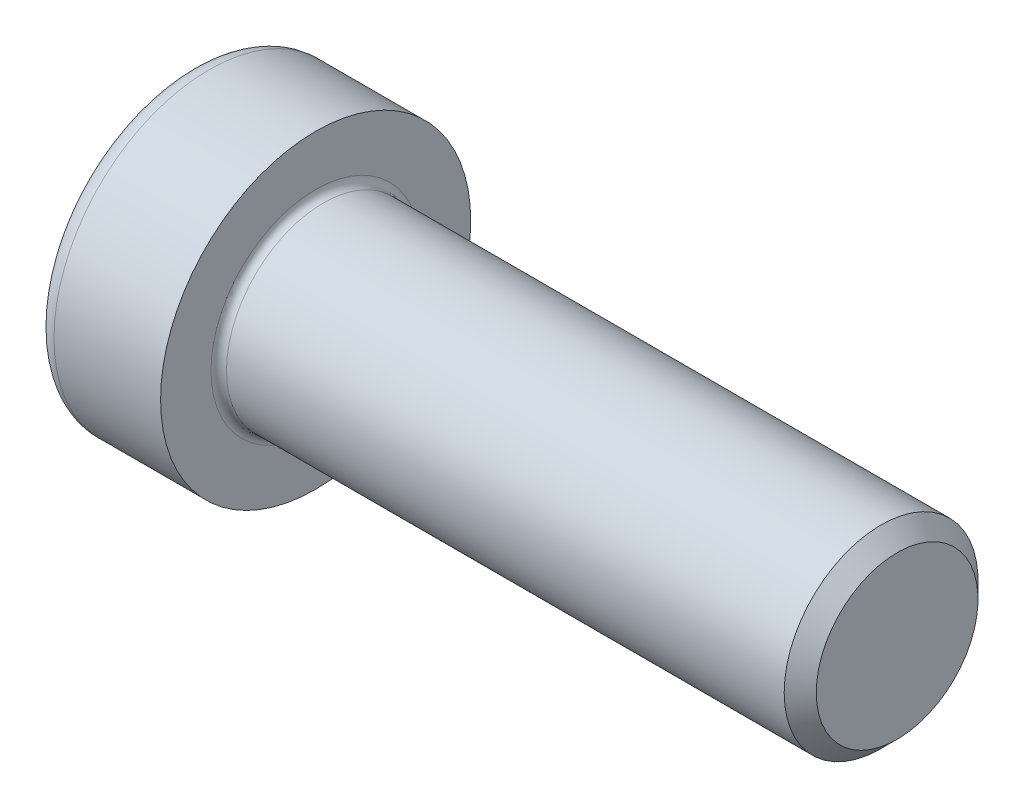
ISO-10303-21;
HEADER;
FILE_DESCRIPTION(('STEP AP214'),'2;1');
FILE_NAME('part.step','',(''),(''),'','','');
FILE_SCHEMA(('AUTOMOTIVE_DESIGN { 1 0 10303 214 1 1 1 1 }'));
ENDSEC;
DATA;
#1=APPLICATION_CONTEXT('core data for automotive mechanical design processes');
#2=APPLICATION_PROTOCOL_DEFINITION('international standard','automotive_design',2000,#1);
#3=PRODUCT_CONTEXT('',#1,'mechanical');
#4=PRODUCT('Part','Part','',(#3));
#5=PRODUCT_RELATED_PRODUCT_CATEGORY('part','',(#4));
#6=PRODUCT_DEFINITION_FORMATION('','',#4);
#7=PRODUCT_DEFINITION_CONTEXT('part definition',#1,'design');
#8=PRODUCT_DEFINITION('design','',#6,#7);
#9=PRODUCT_DEFINITION_SHAPE('','',#8);
#10=(LENGTH_UNIT() NAMED_UNIT(*) SI_UNIT(.MILLI.,.METRE.));
#11=(NAMED_UNIT(*) PLANE_ANGLE_UNIT() SI_UNIT($,.RADIAN.));
#12=(NAMED_UNIT(*) SI_UNIT($,.STERADIAN.) SOLID_ANGLE_UNIT());
#13=UNCERTAINTY_MEASURE_WITH_UNIT(LENGTH_MEASURE(1.E-05),#10,'distance_accuracy_value','');
#14=(GEOMETRIC_REPRESENTATION_CONTEXT(3) GLOBAL_UNCERTAINTY_ASSIGNED_CONTEXT((#13)) GLOBAL_UNIT_ASSIGNED_CONTEXT((#10,
#11,#12)) REPRESENTATION_CONTEXT('',''));
#15=CARTESIAN_POINT('',(0.,0.,0.));
#16=DIRECTION('',(0.,0.,1.));
#17=DIRECTION('',(1.,0.,0.));
#18=AXIS2_PLACEMENT_3D('',#15,#16,#17);
#19=CARTESIAN_POINT('',(3.65,2.35991922531261,4.08749999999999));
#20=DIRECTION('',(-1.,0.,0.));
#21=DIRECTION('',(0.,0.,1.));
#22=AXIS2_PLACEMENT_3D('',#19,#20,#21);
#23=PLANE('',#22);
#24=CARTESIAN_POINT('',(3.65,0.,0.));
#25=DIRECTION('',(-1.,0.,0.));
#26=DIRECTION('',(0.,0.,1.));
#27=AXIS2_PLACEMENT_3D('',#24,#25,#26);
#28=CIRCLE('',#27,4.0875);
#29=CARTESIAN_POINT('',(3.65,0.,4.0875));
#30=VERTEX_POINT('',#29);
#31=CARTESIAN_POINT('',(3.65,3.5398788379689,2.04374999999999));
#32=VERTEX_POINT('',#31);
#33=EDGE_CURVE('E116',#30,#32,#28,.T.);
#34=ORIENTED_EDGE('',*,*,#33,.F.);
#35=DIRECTION('',(0.,1.,0.));
#36=VECTOR('',#35,1.);
#37=CARTESIAN_POINT('',(3.65,-2.35991922531257,4.08749999999999));
#38=LINE('',#37,#36);
#39=CARTESIAN_POINT('',(3.65,2.35991922531261,4.08749999999999));
#40=VERTEX_POINT('',#39);
#41=EDGE_CURVE('E123',#30,#40,#38,.T.);
#42=ORIENTED_EDGE('',*,*,#41,.T.);
#43=DIRECTION('',(0.,-0.499999999999998,0.86602540378444));
#44=VECTOR('',#43,1.);
#45=CARTESIAN_POINT('',(3.65,4.71983845062519,0.));
#46=LINE('',#45,#44);
#47=EDGE_CURVE('E124',#32,#40,#46,.T.);
#48=ORIENTED_EDGE('',*,*,#47,.F.);
#49=EDGE_LOOP('',(#34,#42,#48));
#50=FACE_BOUND('',#49,.T.);
#51=ADVANCED_FACE('F32',(#50),#23,.T.);
#52=CARTESIAN_POINT('',(3.65,0.,0.));
#53=DIRECTION('',(-1.,0.,0.));
#54=DIRECTION('',(0.,0.,1.));
#55=AXIS2_PLACEMENT_3D('',#52,#53,#54);
#56=CIRCLE('',#55,4.0875);
#57=CARTESIAN_POINT('',(3.65,3.53987883796889,-2.04375000000001));
#58=VERTEX_POINT('',#57);
#59=EDGE_CURVE('E11',#32,#58,#56,.T.);
#60=ORIENTED_EDGE('',*,*,#59,.F.);
#61=CARTESIAN_POINT('',(3.65,4.71983845062519,0.));
#62=VERTEX_POINT('',#61);
#63=EDGE_CURVE('E120',#62,#32,#46,.T.);
#64=ORIENTED_EDGE('',*,*,#63,.F.);
#65=DIRECTION('',(0.,-0.500000000000001,-0.866025403784438));
#66=VECTOR('',#65,1.);
#67=CARTESIAN_POINT('',(3.65,4.71983845062519,0.));
#68=LINE('',#67,#66);
#69=EDGE_CURVE('E141',#62,#58,#68,.T.);
#70=ORIENTED_EDGE('',*,*,#69,.T.);
#71=EDGE_LOOP('',(#60,#64,#70));
#72=FACE_BOUND('',#71,.T.);
#73=ADVANCED_FACE('F245',(#72),#23,.T.);
#74=CARTESIAN_POINT('',(3.65,0.,-4.0875));
#75=VERTEX_POINT('',#74);
#76=EDGE_CURVE('E41',#58,#75,#56,.T.);
#77=ORIENTED_EDGE('',*,*,#76,.F.);
#78=CARTESIAN_POINT('',(3.65,2.35991922531259,-4.0875));
#79=VERTEX_POINT('',#78);
#80=EDGE_CURVE('E140',#58,#79,#68,.T.);
#81=ORIENTED_EDGE('',*,*,#80,.T.);
#82=DIRECTION('',(0.,-1.,0.));
#83=VECTOR('',#82,1.);
#84=CARTESIAN_POINT('',(3.65,2.35991922531259,-4.0875));
#85=LINE('',#84,#83);
#86=EDGE_CURVE('E137',#79,#75,#85,.T.);
#87=ORIENTED_EDGE('',*,*,#86,.T.);
#88=EDGE_LOOP('',(#77,#81,#87));
#89=FACE_BOUND('',#88,.T.);
#90=ADVANCED_FACE('F210',(#89),#23,.T.);
#91=CARTESIAN_POINT('',(3.65,-3.5398788379689,-2.04374999999999));
#92=VERTEX_POINT('',#91);
#93=EDGE_CURVE('E194',#75,#92,#56,.T.);
#94=ORIENTED_EDGE('',*,*,#93,.F.);
#95=CARTESIAN_POINT('',(3.65,-2.35991922531259,-4.0875));
#96=VERTEX_POINT('',#95);
#97=EDGE_CURVE('E136',#75,#96,#85,.T.);
#98=ORIENTED_EDGE('',*,*,#97,.T.);
#99=DIRECTION('',(0.,0.499999999999998,-0.86602540378444));
#100=VECTOR('',#99,1.);
#101=CARTESIAN_POINT('',(3.65,-4.71983845062517,0.));
#102=LINE('',#101,#100);
#103=EDGE_CURVE('E132',#92,#96,#102,.T.);
#104=ORIENTED_EDGE('',*,*,#103,.F.);
#105=EDGE_LOOP('',(#94,#98,#104));
#106=FACE_BOUND('',#105,.T.);
#107=ADVANCED_FACE('F205',(#106),#23,.T.);
#108=CARTESIAN_POINT('',(3.65,-3.53987883796887,2.04374999999999));
#109=VERTEX_POINT('',#108);
#110=EDGE_CURVE('E48',#92,#109,#56,.T.);
#111=ORIENTED_EDGE('',*,*,#110,.F.);
#112=CARTESIAN_POINT('',(3.65,-4.71983845062517,0.));
#113=VERTEX_POINT('',#112);
#114=EDGE_CURVE('E133',#113,#92,#102,.T.);
#115=ORIENTED_EDGE('',*,*,#114,.F.);
#116=DIRECTION('',(0.,-0.500000000000001,-0.866025403784438));
#117=VECTOR('',#116,1.);
#118=CARTESIAN_POINT('',(3.65,-2.35991922531257,4.08749999999999));
#119=LINE('',#118,#117);
#120=EDGE_CURVE('E128',#109,#113,#119,.T.);
#121=ORIENTED_EDGE('',*,*,#120,.F.);
#122=EDGE_LOOP('',(#111,#115,#121));
#123=FACE_BOUND('',#122,.T.);
#124=ADVANCED_FACE('F228',(#123),#23,.T.);
#125=CARTESIAN_POINT('',(0.,0.,0.));
#126=DIRECTION('',(-1.,0.,0.));
#127=DIRECTION('',(0.,0.,1.));
#128=AXIS2_PLACEMENT_3D('',#125,#126,#127);
#129=PLANE('',#128);
#130=CARTESIAN_POINT('',(0.,0.,0.));
#131=DIRECTION('',(-1.,0.,0.));
#132=DIRECTION('',(0.,0.,1.));
#133=AXIS2_PLACEMENT_3D('',#130,#131,#132);
#134=CIRCLE('',#133,7.);
#135=CARTESIAN_POINT('',(0.,0.,7.));
#136=VERTEX_POINT('',#135);
#137=EDGE_CURVE('E187',#136,#136,#134,.T.);
#138=ORIENTED_EDGE('',*,*,#137,.T.);
#139=EDGE_LOOP('',(#138));
#140=FACE_BOUND('',#139,.T.);
#141=DIRECTION('',(0.,-0.500000000000001,-0.866025403784438));
#142=VECTOR('',#141,1.);
#143=CARTESIAN_POINT('',(0.,4.71983845062519,0.));
#144=LINE('',#143,#142);
#145=CARTESIAN_POINT('',(0.,4.71983845062519,0.));
#146=VERTEX_POINT('',#145);
#147=CARTESIAN_POINT('',(0.,2.35991922531259,-4.0875));
#148=VERTEX_POINT('',#147);
#149=EDGE_CURVE('E156',#146,#148,#144,.T.);
#150=ORIENTED_EDGE('',*,*,#149,.F.);
#151=DIRECTION('',(0.,-0.499999999999998,0.86602540378444));
#152=VECTOR('',#151,1.);
#153=CARTESIAN_POINT('',(0.,4.71983845062519,0.));
#154=LINE('',#153,#152);
#155=CARTESIAN_POINT('',(0.,2.35991922531261,4.08749999999999));
#156=VERTEX_POINT('',#155);
#157=EDGE_CURVE('E56',#146,#156,#154,.T.);
#158=ORIENTED_EDGE('',*,*,#157,.T.);
#159=DIRECTION('',(0.,1.,0.));
#160=VECTOR('',#159,1.);
#161=CARTESIAN_POINT('',(0.,-2.35991922531257,4.08749999999999));
#162=LINE('',#161,#160);
#163=CARTESIAN_POINT('',(0.,-2.35991922531257,4.08749999999999));
#164=VERTEX_POINT('',#163);
#165=EDGE_CURVE('E146',#164,#156,#162,.T.);
#166=ORIENTED_EDGE('',*,*,#165,.F.);
#167=DIRECTION('',(0.,-0.500000000000001,-0.866025403784438));
#168=VECTOR('',#167,1.);
#169=CARTESIAN_POINT('',(0.,-2.35991922531257,4.08749999999999));
#170=LINE('',#169,#168);
#171=CARTESIAN_POINT('',(0.,-4.71983845062517,0.));
#172=VERTEX_POINT('',#171);
#173=EDGE_CURVE('E149',#164,#172,#170,.T.);
#174=ORIENTED_EDGE('',*,*,#173,.T.);
#175=DIRECTION('',(0.,0.499999999999998,-0.86602540378444));
#176=VECTOR('',#175,1.);
#177=CARTESIAN_POINT('',(0.,-4.71983845062517,0.));
#178=LINE('',#177,#176);
#179=CARTESIAN_POINT('',(0.,-2.35991922531259,-4.0875));
#180=VERTEX_POINT('',#179);
#181=EDGE_CURVE('E151',#172,#180,#178,.T.);
#182=ORIENTED_EDGE('',*,*,#181,.T.);
#183=DIRECTION('',(0.,-1.,0.));
#184=VECTOR('',#183,1.);
#185=CARTESIAN_POINT('',(0.,2.35991922531259,-4.0875));
#186=LINE('',#185,#184);
#187=EDGE_CURVE('E153',#148,#180,#186,.T.);
#188=ORIENTED_EDGE('',*,*,#187,.F.);
#189=EDGE_LOOP('',(#150,#158,#166,#174,#182,#188));
#190=FACE_BOUND('',#189,.T.);
#191=ADVANCED_FACE('F218',(#140,#190),#129,.T.);
#192=CARTESIAN_POINT('',(-31.75,0.,0.));
#193=DIRECTION('',(-1.,0.,0.));
#194=DIRECTION('',(0.,0.,1.));
#195=AXIS2_PLACEMENT_3D('',#192,#193,#194);
#196=CYLINDRICAL_SURFACE('',#195,8.);
#197=CARTESIAN_POINT('',(1.,0.,0.));
#198=DIRECTION('',(-1.,0.,0.));
#199=DIRECTION('',(0.,0.,1.));
#200=AXIS2_PLACEMENT_3D('',#197,#198,#199);
#201=CIRCLE('',#200,8.);
#202=CARTESIAN_POINT('',(1.,0.,8.));
#203=VERTEX_POINT('',#202);
#204=EDGE_CURVE('E189',#203,#203,#201,.F.);
#205=ORIENTED_EDGE('',*,*,#204,.T.);
#206=EDGE_LOOP('',(#205));
#207=FACE_BOUND('',#206,.T.);
#208=CARTESIAN_POINT('',(6.5,0.,0.));
#209=DIRECTION('',(-1.,0.,0.));
#210=DIRECTION('',(0.,0.,1.));
#211=AXIS2_PLACEMENT_3D('',#208,#209,#210);
#212=CIRCLE('',#211,8.);
#213=CARTESIAN_POINT('',(6.5,0.,8.));
#214=VERTEX_POINT('',#213);
#215=EDGE_CURVE('E178',#214,#214,#212,.T.);
#216=ORIENTED_EDGE('',*,*,#215,.T.);
#217=EDGE_LOOP('',(#216));
#218=FACE_BOUND('',#217,.T.);
#219=ADVANCED_FACE('F284',(#207,#218),#196,.T.);
#220=CARTESIAN_POINT('',(6.5,8.,0.));
#221=DIRECTION('',(1.,0.,0.));
#222=DIRECTION('',(0.,0.,-1.));
#223=AXIS2_PLACEMENT_3D('',#220,#221,#222);
#224=PLANE('',#223);
#225=CARTESIAN_POINT('',(6.5,0.,0.));
#226=DIRECTION('',(1.,0.,0.));
#227=DIRECTION('',(0.,0.,-1.));
#228=AXIS2_PLACEMENT_3D('',#225,#226,#227);
#229=CIRCLE('',#228,5.4);
#230=CARTESIAN_POINT('',(6.5,0.,-5.4));
#231=VERTEX_POINT('',#230);
#232=EDGE_CURVE('E181',#231,#231,#229,.F.);
#233=ORIENTED_EDGE('',*,*,#232,.T.);
#234=EDGE_LOOP('',(#233));
#235=FACE_BOUND('',#234,.T.);
#236=ORIENTED_EDGE('',*,*,#215,.F.);
#237=EDGE_LOOP('',(#236));
#238=FACE_BOUND('',#237,.T.);
#239=ADVANCED_FACE('F280',(#235,#238),#224,.T.);
#240=CARTESIAN_POINT('',(-31.75,0.,0.));
#241=DIRECTION('',(-1.,0.,0.));
#242=DIRECTION('',(0.,0.,1.));
#243=AXIS2_PLACEMENT_3D('',#240,#241,#242);
#244=CYLINDRICAL_SURFACE('',#243,5.);
#245=CARTESIAN_POINT('',(6.9,0.,0.));
#246=DIRECTION('',(1.,0.,0.));
#247=DIRECTION('',(0.,0.,-1.));
#248=AXIS2_PLACEMENT_3D('',#245,#246,#247);
#249=CIRCLE('',#248,5.);
#250=CARTESIAN_POINT('',(6.9,0.,-5.));
#251=VERTEX_POINT('',#250);
#252=EDGE_CURVE('E184',#251,#251,#249,.T.);
#253=ORIENTED_EDGE('',*,*,#252,.T.);
#254=EDGE_LOOP('',(#253));
#255=FACE_BOUND('',#254,.T.);
#256=CARTESIAN_POINT('',(35.672,0.,0.));
#257=DIRECTION('',(-1.,0.,0.));
#258=DIRECTION('',(0.,0.,1.));
#259=AXIS2_PLACEMENT_3D('',#256,#257,#258);
#260=CIRCLE('',#259,5.);
#261=CARTESIAN_POINT('',(35.672,0.,5.));
#262=VERTEX_POINT('',#261);
#263=EDGE_CURVE('E175',#262,#262,#260,.T.);
#264=ORIENTED_EDGE('',*,*,#263,.T.);
#265=EDGE_LOOP('',(#264));
#266=FACE_BOUND('',#265,.T.);
#267=ADVANCED_FACE('F276',(#255,#266),#244,.T.);
#268=CARTESIAN_POINT('',(36.5,0.,0.));
#269=DIRECTION('',(-1.,0.,0.));
#270=DIRECTION('',(0.,0.,1.));
#271=AXIS2_PLACEMENT_3D('',#268,#269,#270);
#272=CONICAL_SURFACE('',#271,4.172,0.785398163397434);
#273=ORIENTED_EDGE('',*,*,#263,.F.);
#274=EDGE_LOOP('',(#273));
#275=FACE_BOUND('',#274,.T.);
#276=CARTESIAN_POINT('',(36.5,0.,0.));
#277=DIRECTION('',(-1.,0.,0.));
#278=DIRECTION('',(0.,0.,1.));
#279=AXIS2_PLACEMENT_3D('',#276,#277,#278);
#280=CIRCLE('',#279,4.172);
#281=CARTESIAN_POINT('',(36.5,0.,4.172));
#282=VERTEX_POINT('',#281);
#283=EDGE_CURVE('E172',#282,#282,#280,.T.);
#284=ORIENTED_EDGE('',*,*,#283,.T.);
#285=EDGE_LOOP('',(#284));
#286=FACE_BOUND('',#285,.T.);
#287=ADVANCED_FACE('F272',(#275,#286),#272,.T.);
#288=CARTESIAN_POINT('',(36.5,4.172,0.));
#289=DIRECTION('',(1.,0.,0.));
#290=DIRECTION('',(0.,0.,-1.));
#291=AXIS2_PLACEMENT_3D('',#288,#289,#290);
#292=PLANE('',#291);
#293=ORIENTED_EDGE('',*,*,#283,.F.);
#294=EDGE_LOOP('',(#293));
#295=FACE_BOUND('',#294,.T.);
#296=ADVANCED_FACE('F268',(#295),#292,.T.);
#297=CARTESIAN_POINT('',(6.9,0.,0.));
#298=DIRECTION('',(1.,0.,0.));
#299=DIRECTION('',(0.,0.,-1.));
#300=AXIS2_PLACEMENT_3D('',#297,#298,#299);
#301=TOROIDAL_SURFACE('',#300,5.4,0.4);
#302=ORIENTED_EDGE('',*,*,#252,.F.);
#303=EDGE_LOOP('',(#302));
#304=FACE_BOUND('',#303,.T.);
#305=ORIENTED_EDGE('',*,*,#232,.F.);
#306=EDGE_LOOP('',(#305));
#307=FACE_BOUND('',#306,.T.);
#308=ADVANCED_FACE('F271',(#304,#307),#301,.F.);
#309=CARTESIAN_POINT('',(1.,0.,0.));
#310=DIRECTION('',(-1.,0.,0.));
#311=DIRECTION('',(0.,0.,1.));
#312=AXIS2_PLACEMENT_3D('',#309,#310,#311);
#313=TOROIDAL_SURFACE('',#312,7.,1.);
#314=ORIENTED_EDGE('',*,*,#204,.F.);
#315=EDGE_LOOP('',(#314));
#316=FACE_BOUND('',#315,.T.);
#317=ORIENTED_EDGE('',*,*,#137,.F.);
#318=EDGE_LOOP('',(#317));
#319=FACE_BOUND('',#318,.T.);
#320=ADVANCED_FACE('F34',(#316,#319),#313,.T.);
#321=CARTESIAN_POINT('',(3.65,4.71983845062519,0.));
#322=DIRECTION('',(0.,-0.86602540378444,-0.499999999999998));
#323=DIRECTION('',(0.,0.499999999999998,-0.86602540378444));
#324=AXIS2_PLACEMENT_3D('',#321,#322,#323);
#325=PLANE('',#324);
#326=DIRECTION('',(-1.,0.,0.));
#327=VECTOR('',#326,1.);
#328=CARTESIAN_POINT('',(3.65,2.35991922531261,4.08749999999999));
#329=LINE('',#328,#327);
#330=EDGE_CURVE('E170',#40,#156,#329,.T.);
#331=ORIENTED_EDGE('',*,*,#330,.T.);
#332=ORIENTED_EDGE('',*,*,#157,.F.);
#333=DIRECTION('',(-1.,0.,0.));
#334=VECTOR('',#333,1.);
#335=CARTESIAN_POINT('',(3.65,4.71983845062519,0.));
#336=LINE('',#335,#334);
#337=EDGE_CURVE('E144',#62,#146,#336,.T.);
#338=ORIENTED_EDGE('',*,*,#337,.F.);
#339=ORIENTED_EDGE('',*,*,#63,.T.);
#340=ORIENTED_EDGE('',*,*,#47,.T.);
#341=EDGE_LOOP('',(#331,#332,#338,#339,#340));
#342=FACE_BOUND('',#341,.T.);
#343=ADVANCED_FACE('F242',(#342),#325,.T.);
#344=CARTESIAN_POINT('',(3.65,-2.35991922531257,4.08749999999999));
#345=DIRECTION('',(0.,0.,1.));
#346=DIRECTION('',(0.,-1.,0.));
#347=AXIS2_PLACEMENT_3D('',#344,#345,#346);
#348=PLANE('',#347);
#349=ORIENTED_EDGE('',*,*,#41,.F.);
#350=CARTESIAN_POINT('',(3.65,-2.35991922531257,4.08749999999999));
#351=VERTEX_POINT('',#350);
#352=EDGE_CURVE('E125',#351,#30,#38,.T.);
#353=ORIENTED_EDGE('',*,*,#352,.F.);
#354=DIRECTION('',(-1.,0.,0.));
#355=VECTOR('',#354,1.);
#356=CARTESIAN_POINT('',(3.65,-2.35991922531257,4.08749999999999));
#357=LINE('',#356,#355);
#358=EDGE_CURVE('E168',#351,#164,#357,.T.);
#359=ORIENTED_EDGE('',*,*,#358,.T.);
#360=ORIENTED_EDGE('',*,*,#165,.T.);
#361=ORIENTED_EDGE('',*,*,#330,.F.);
#362=EDGE_LOOP('',(#349,#353,#359,#360,#361));
#363=FACE_BOUND('',#362,.T.);
#364=ADVANCED_FACE('F237',(#363),#348,.F.);
#365=CARTESIAN_POINT('',(3.65,-2.35991922531257,4.08749999999999));
#366=DIRECTION('',(0.,0.866025403784438,-0.500000000000001));
#367=DIRECTION('',(0.,0.500000000000001,0.866025403784438));
#368=AXIS2_PLACEMENT_3D('',#365,#366,#367);
#369=PLANE('',#368);
#370=DIRECTION('',(-1.,0.,0.));
#371=VECTOR('',#370,1.);
#372=CARTESIAN_POINT('',(3.65,-4.71983845062517,0.));
#373=LINE('',#372,#371);
#374=EDGE_CURVE('E165',#113,#172,#373,.T.);
#375=ORIENTED_EDGE('',*,*,#374,.T.);
#376=ORIENTED_EDGE('',*,*,#173,.F.);
#377=ORIENTED_EDGE('',*,*,#358,.F.);
#378=EDGE_CURVE('E129',#351,#109,#119,.T.);
#379=ORIENTED_EDGE('',*,*,#378,.T.);
#380=ORIENTED_EDGE('',*,*,#120,.T.);
#381=EDGE_LOOP('',(#375,#376,#377,#379,#380));
#382=FACE_BOUND('',#381,.T.);
#383=ADVANCED_FACE('F231',(#382),#369,.T.);
#384=CARTESIAN_POINT('',(3.65,-4.71983845062517,0.));
#385=DIRECTION('',(0.,0.86602540378444,0.499999999999998));
#386=DIRECTION('',(0.,-0.499999999999998,0.86602540378444));
#387=AXIS2_PLACEMENT_3D('',#384,#385,#386);
#388=PLANE('',#387);
#389=DIRECTION('',(-1.,0.,0.));
#390=VECTOR('',#389,1.);
#391=CARTESIAN_POINT('',(3.65,-2.35991922531259,-4.0875));
#392=LINE('',#391,#390);
#393=EDGE_CURVE('E162',#96,#180,#392,.T.);
#394=ORIENTED_EDGE('',*,*,#393,.T.);
#395=ORIENTED_EDGE('',*,*,#181,.F.);
#396=ORIENTED_EDGE('',*,*,#374,.F.);
#397=ORIENTED_EDGE('',*,*,#114,.T.);
#398=ORIENTED_EDGE('',*,*,#103,.T.);
#399=EDGE_LOOP('',(#394,#395,#396,#397,#398));
#400=FACE_BOUND('',#399,.T.);
#401=ADVANCED_FACE('F224',(#400),#388,.T.);
#402=CARTESIAN_POINT('',(3.65,2.35991922531259,-4.0875));
#403=DIRECTION('',(0.,0.,-1.));
#404=DIRECTION('',(0.,1.,0.));
#405=AXIS2_PLACEMENT_3D('',#402,#403,#404);
#406=PLANE('',#405);
#407=ORIENTED_EDGE('',*,*,#97,.F.);
#408=ORIENTED_EDGE('',*,*,#86,.F.);
#409=DIRECTION('',(-1.,0.,0.));
#410=VECTOR('',#409,1.);
#411=CARTESIAN_POINT('',(3.65,2.35991922531259,-4.0875));
#412=LINE('',#411,#410);
#413=EDGE_CURVE('E159',#79,#148,#412,.T.);
#414=ORIENTED_EDGE('',*,*,#413,.T.);
#415=ORIENTED_EDGE('',*,*,#187,.T.);
#416=ORIENTED_EDGE('',*,*,#393,.F.);
#417=EDGE_LOOP('',(#407,#408,#414,#415,#416));
#418=FACE_BOUND('',#417,.T.);
#419=ADVANCED_FACE('F209',(#418),#406,.F.);
#420=CARTESIAN_POINT('',(3.65,4.71983845062519,0.));
#421=DIRECTION('',(0.,0.866025403784438,-0.500000000000001));
#422=DIRECTION('',(0.,0.500000000000001,0.866025403784438));
#423=AXIS2_PLACEMENT_3D('',#420,#421,#422);
#424=PLANE('',#423);
#425=ORIENTED_EDGE('',*,*,#80,.F.);
#426=ORIENTED_EDGE('',*,*,#69,.F.);
#427=ORIENTED_EDGE('',*,*,#337,.T.);
#428=ORIENTED_EDGE('',*,*,#149,.T.);
#429=ORIENTED_EDGE('',*,*,#413,.F.);
#430=EDGE_LOOP('',(#425,#426,#427,#428,#429));
#431=FACE_BOUND('',#430,.T.);
#432=ADVANCED_FACE('F214',(#431),#424,.F.);
#433=EDGE_CURVE('E36',#109,#30,#56,.T.);
#434=ORIENTED_EDGE('',*,*,#433,.F.);
#435=ORIENTED_EDGE('',*,*,#378,.F.);
#436=ORIENTED_EDGE('',*,*,#352,.T.);
#437=EDGE_LOOP('',(#434,#435,#436));
#438=FACE_BOUND('',#437,.T.);
#439=ADVANCED_FACE('F234',(#438),#23,.T.);
#440=CARTESIAN_POINT('',(3.65,0.,0.));
#441=DIRECTION('',(-1.,0.,0.));
#442=DIRECTION('',(0.,0.,1.));
#443=AXIS2_PLACEMENT_3D('',#440,#441,#442);
#444=CONICAL_SURFACE('',#443,4.0875,1.04719755119659);
#445=CARTESIAN_POINT('',(4.54489291724393,0.,0.));
#446=DIRECTION('',(-1.,0.,0.));
#447=DIRECTION('',(0.,0.,1.));
#448=AXIS2_PLACEMENT_3D('',#445,#446,#447);
#449=CIRCLE('',#448,2.5375);
#450=CARTESIAN_POINT('',(4.54489291724393,0.,2.5375));
#451=VERTEX_POINT('',#450);
#452=EDGE_CURVE('E113',#451,#451,#449,.T.);
#453=ORIENTED_EDGE('',*,*,#452,.F.);
#454=EDGE_LOOP('',(#453));
#455=FACE_BOUND('',#454,.T.);
#456=ORIENTED_EDGE('',*,*,#33,.T.);
#457=ORIENTED_EDGE('',*,*,#59,.T.);
#458=ORIENTED_EDGE('',*,*,#76,.T.);
#459=ORIENTED_EDGE('',*,*,#93,.T.);
#460=ORIENTED_EDGE('',*,*,#110,.T.);
#461=ORIENTED_EDGE('',*,*,#433,.T.);
#462=EDGE_LOOP('',(#456,#457,#458,#459,#460,#461));
#463=FACE_BOUND('',#462,.T.);
#464=ADVANCED_FACE('F197',(#455,#463),#444,.F.);
#465=CARTESIAN_POINT('',(0.,0.,0.));
#466=DIRECTION('',(-1.,0.,0.));
#467=DIRECTION('',(0.,0.,1.));
#468=AXIS2_PLACEMENT_3D('',#465,#466,#467);
#469=CYLINDRICAL_SURFACE('',#468,2.5375);
#470=CARTESIAN_POINT('',(7.86,0.,0.));
#471=DIRECTION('',(-1.,0.,0.));
#472=DIRECTION('',(0.,0.,1.));
#473=AXIS2_PLACEMENT_3D('',#470,#471,#472);
#474=CIRCLE('',#473,2.5375);
#475=CARTESIAN_POINT('',(7.86,0.,2.5375));
#476=VERTEX_POINT('',#475);
#477=EDGE_CURVE('E111',#476,#476,#474,.T.);
#478=ORIENTED_EDGE('',*,*,#477,.F.);
#479=EDGE_LOOP('',(#478));
#480=FACE_BOUND('',#479,.T.);
#481=ORIENTED_EDGE('',*,*,#452,.T.);
#482=EDGE_LOOP('',(#481));
#483=FACE_BOUND('',#482,.T.);
#484=ADVANCED_FACE('F107',(#480,#483),#469,.F.);
#485=CARTESIAN_POINT('',(7.86,0.,0.));
#486=DIRECTION('',(-1.,0.,0.));
#487=DIRECTION('',(0.,0.,1.));
#488=AXIS2_PLACEMENT_3D('',#485,#486,#487);
#489=CONICAL_SURFACE('',#488,2.5375,1.04719755119659);
#490=CARTESIAN_POINT('',(9.3250263080687,0.,0.));
#491=VERTEX_POINT('',#490);
#492=VERTEX_LOOP('',#491);
#493=FACE_BOUND('',#492,.T.);
#494=ORIENTED_EDGE('',*,*,#477,.T.);
#495=EDGE_LOOP('',(#494));
#496=FACE_BOUND('',#495,.T.);
#497=ADVANCED_FACE('F104',(#493,#496),#489,.F.);
#498=CLOSED_SHELL('',(#51,#73,#90,#107,#124,#191,#219,#239,#267,#287,#296,#308,#320,#343,#364,
#383,#401,#419,#432,#439,#464,#484,#497));
#499=MANIFOLD_SOLID_BREP('B2',#498);
#500=ADVANCED_BREP_SHAPE_REPRESENTATION('',(#18,#499),#14);
#501=SHAPE_DEFINITION_REPRESENTATION(#9,#500);
ENDSEC;
END-ISO-10303-21;
